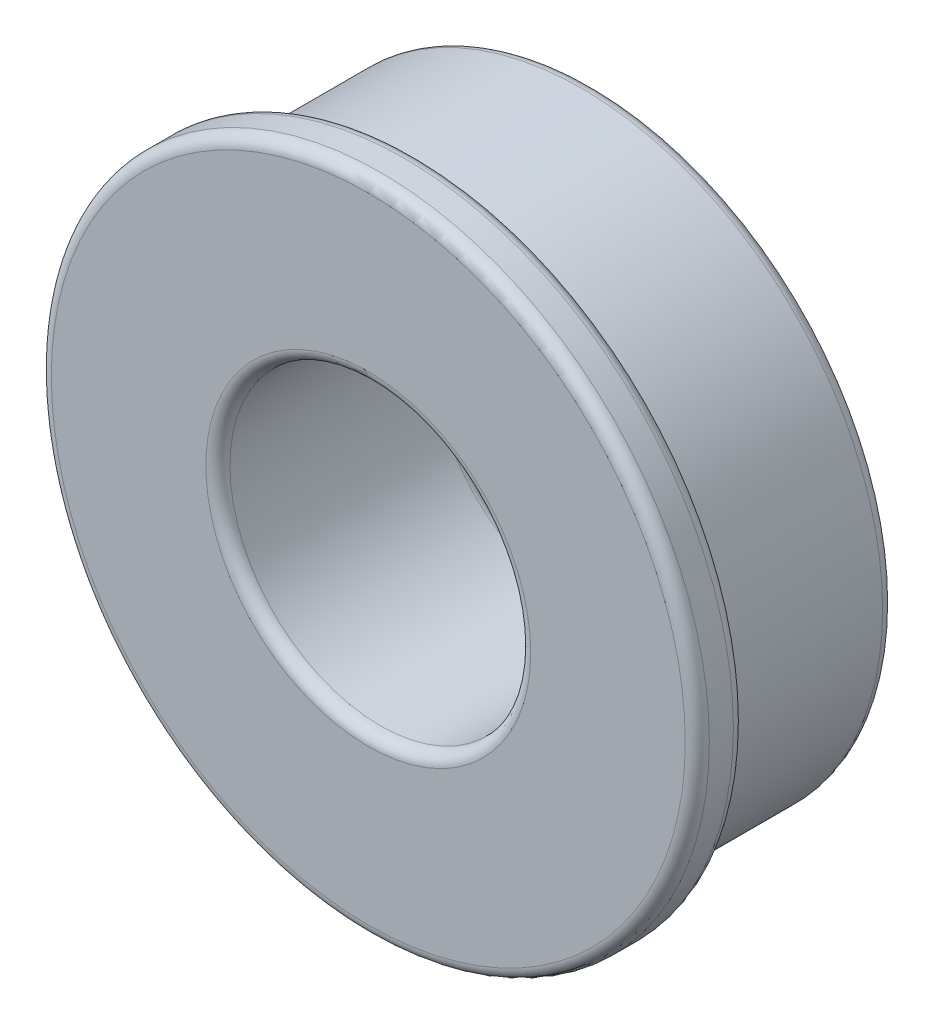
ISO-10303-21;
HEADER;
FILE_DESCRIPTION(('STEP AP214'),'2;1');
FILE_NAME('part.step','',(''),(''),'','','');
FILE_SCHEMA(('AUTOMOTIVE_DESIGN { 1 0 10303 214 1 1 1 1 }'));
ENDSEC;
DATA;
#1=APPLICATION_CONTEXT('core data for automotive mechanical design processes');
#2=APPLICATION_PROTOCOL_DEFINITION('international standard','automotive_design',2000,#1);
#3=PRODUCT_CONTEXT('',#1,'mechanical');
#4=PRODUCT('Part','Part','',(#3));
#5=PRODUCT_RELATED_PRODUCT_CATEGORY('part','',(#4));
#6=PRODUCT_DEFINITION_FORMATION('','',#4);
#7=PRODUCT_DEFINITION_CONTEXT('part definition',#1,'design');
#8=PRODUCT_DEFINITION('design','',#6,#7);
#9=PRODUCT_DEFINITION_SHAPE('','',#8);
#10=(LENGTH_UNIT() NAMED_UNIT(*) SI_UNIT(.MILLI.,.METRE.));
#11=(NAMED_UNIT(*) PLANE_ANGLE_UNIT() SI_UNIT($,.RADIAN.));
#12=(NAMED_UNIT(*) SI_UNIT($,.STERADIAN.) SOLID_ANGLE_UNIT());
#13=UNCERTAINTY_MEASURE_WITH_UNIT(LENGTH_MEASURE(1.E-05),#10,'distance_accuracy_value','');
#14=(GEOMETRIC_REPRESENTATION_CONTEXT(3) GLOBAL_UNCERTAINTY_ASSIGNED_CONTEXT((#13)) GLOBAL_UNIT_ASSIGNED_CONTEXT((#10,
#11,#12)) REPRESENTATION_CONTEXT('',''));
#15=CARTESIAN_POINT('',(0.,0.,0.));
#16=DIRECTION('',(0.,0.,1.));
#17=DIRECTION('',(1.,0.,0.));
#18=AXIS2_PLACEMENT_3D('',#15,#16,#17);
#19=CARTESIAN_POINT('',(0.,0.,4.7625));
#20=DIRECTION('',(0.,0.,-1.));
#21=DIRECTION('',(-1.,0.,0.));
#22=AXIS2_PLACEMENT_3D('',#19,#20,#21);
#23=CYLINDRICAL_SURFACE('',#22,6.35);
#24=CARTESIAN_POINT('',(0.,0.,3.4925));
#25=DIRECTION('',(0.,0.,1.));
#26=DIRECTION('',(1.,0.,0.));
#27=AXIS2_PLACEMENT_3D('',#24,#25,#26);
#28=CIRCLE('',#27,6.35);
#29=CARTESIAN_POINT('',(6.35,0.,3.4925));
#30=VERTEX_POINT('',#29);
#31=EDGE_CURVE('E61',#30,#30,#28,.F.);
#32=ORIENTED_EDGE('',*,*,#31,.T.);
#33=EDGE_LOOP('',(#32));
#34=FACE_BOUND('',#33,.T.);
#35=CARTESIAN_POINT('',(0.,0.,0.254));
#36=DIRECTION('',(0.,0.,1.));
#37=DIRECTION('',(1.,0.,0.));
#38=AXIS2_PLACEMENT_3D('',#35,#36,#37);
#39=CIRCLE('',#38,6.35);
#40=CARTESIAN_POINT('',(6.35,0.,0.254));
#41=VERTEX_POINT('',#40);
#42=EDGE_CURVE('E65',#41,#41,#39,.T.);
#43=ORIENTED_EDGE('',*,*,#42,.T.);
#44=EDGE_LOOP('',(#43));
#45=FACE_BOUND('',#44,.T.);
#46=ADVANCED_FACE('F37',(#34,#45),#23,.T.);
#47=CARTESIAN_POINT('',(0.,0.,0.));
#48=DIRECTION('',(0.,0.,1.));
#49=DIRECTION('',(1.,0.,0.));
#50=AXIS2_PLACEMENT_3D('',#47,#48,#49);
#51=PLANE('',#50);
#52=CARTESIAN_POINT('',(0.,0.,0.));
#53=DIRECTION('',(0.,0.,1.));
#54=DIRECTION('',(1.,0.,0.));
#55=AXIS2_PLACEMENT_3D('',#52,#53,#54);
#56=CIRCLE('',#55,6.096);
#57=CARTESIAN_POINT('',(6.096,0.,0.));
#58=VERTEX_POINT('',#57);
#59=EDGE_CURVE('E50',#58,#58,#56,.F.);
#60=ORIENTED_EDGE('',*,*,#59,.T.);
#61=EDGE_LOOP('',(#60));
#62=FACE_BOUND('',#61,.T.);
#63=CARTESIAN_POINT('',(0.,0.,0.));
#64=DIRECTION('',(0.,0.,1.));
#65=DIRECTION('',(1.,0.,0.));
#66=AXIS2_PLACEMENT_3D('',#63,#64,#65);
#67=CIRCLE('',#66,3.429);
#68=CARTESIAN_POINT('',(3.429,0.,0.));
#69=VERTEX_POINT('',#68);
#70=EDGE_CURVE('E55',#69,#69,#67,.T.);
#71=ORIENTED_EDGE('',*,*,#70,.T.);
#72=EDGE_LOOP('',(#71));
#73=FACE_BOUND('',#72,.T.);
#74=ADVANCED_FACE('F110',(#62,#73),#51,.F.);
#75=CARTESIAN_POINT('',(0.,0.,3.7465));
#76=DIRECTION('',(0.,0.,1.));
#77=DIRECTION('',(1.,0.,0.));
#78=AXIS2_PLACEMENT_3D('',#75,#76,#77);
#79=CYLINDRICAL_SURFACE('',#78,6.9453125);
#80=CARTESIAN_POINT('',(0.,0.,4.0005));
#81=DIRECTION('',(0.,0.,1.));
#82=DIRECTION('',(1.,0.,0.));
#83=AXIS2_PLACEMENT_3D('',#80,#81,#82);
#84=CIRCLE('',#83,6.9453125);
#85=CARTESIAN_POINT('',(6.9453125,0.,4.0005));
#86=VERTEX_POINT('',#85);
#87=EDGE_CURVE('E10',#86,#86,#84,.T.);
#88=ORIENTED_EDGE('',*,*,#87,.T.);
#89=EDGE_LOOP('',(#88));
#90=FACE_BOUND('',#89,.T.);
#91=CARTESIAN_POINT('',(0.,0.,4.5085));
#92=DIRECTION('',(0.,0.,1.));
#93=DIRECTION('',(1.,0.,0.));
#94=AXIS2_PLACEMENT_3D('',#91,#92,#93);
#95=CIRCLE('',#94,6.9453125);
#96=CARTESIAN_POINT('',(6.9453125,0.,4.5085));
#97=VERTEX_POINT('',#96);
#98=EDGE_CURVE('E45',#97,#97,#95,.F.);
#99=ORIENTED_EDGE('',*,*,#98,.T.);
#100=EDGE_LOOP('',(#99));
#101=FACE_BOUND('',#100,.T.);
#102=ADVANCED_FACE('F116',(#90,#101),#79,.T.);
#103=CARTESIAN_POINT('',(0.,0.,3.7465));
#104=DIRECTION('',(0.,0.,1.));
#105=DIRECTION('',(1.,0.,0.));
#106=AXIS2_PLACEMENT_3D('',#103,#104,#105);
#107=PLANE('',#106);
#108=CARTESIAN_POINT('',(0.,0.,3.7465));
#109=DIRECTION('',(0.,0.,1.));
#110=DIRECTION('',(1.,0.,0.));
#111=AXIS2_PLACEMENT_3D('',#108,#109,#110);
#112=CIRCLE('',#111,6.604);
#113=CARTESIAN_POINT('',(6.604,0.,3.7465));
#114=VERTEX_POINT('',#113);
#115=EDGE_CURVE('E69',#114,#114,#112,.T.);
#116=ORIENTED_EDGE('',*,*,#115,.T.);
#117=EDGE_LOOP('',(#116));
#118=FACE_BOUND('',#117,.T.);
#119=CARTESIAN_POINT('',(0.,0.,3.7465));
#120=DIRECTION('',(0.,0.,1.));
#121=DIRECTION('',(1.,0.,0.));
#122=AXIS2_PLACEMENT_3D('',#119,#120,#121);
#123=CIRCLE('',#122,6.6913125);
#124=CARTESIAN_POINT('',(6.6913125,0.,3.7465));
#125=VERTEX_POINT('',#124);
#126=EDGE_CURVE('E73',#125,#125,#123,.F.);
#127=ORIENTED_EDGE('',*,*,#126,.T.);
#128=EDGE_LOOP('',(#127));
#129=FACE_BOUND('',#128,.T.);
#130=ADVANCED_FACE('F185',(#118,#129),#107,.F.);
#131=CARTESIAN_POINT('',(0.,0.,4.7625));
#132=DIRECTION('',(0.,0.,1.));
#133=DIRECTION('',(1.,0.,0.));
#134=AXIS2_PLACEMENT_3D('',#131,#132,#133);
#135=PLANE('',#134);
#136=CARTESIAN_POINT('',(0.,0.,4.7625));
#137=DIRECTION('',(0.,0.,1.));
#138=DIRECTION('',(1.,0.,0.));
#139=AXIS2_PLACEMENT_3D('',#136,#137,#138);
#140=CIRCLE('',#139,3.429);
#141=CARTESIAN_POINT('',(3.429,0.,4.7625));
#142=VERTEX_POINT('',#141);
#143=EDGE_CURVE('E77',#142,#142,#140,.F.);
#144=ORIENTED_EDGE('',*,*,#143,.T.);
#145=EDGE_LOOP('',(#144));
#146=FACE_BOUND('',#145,.T.);
#147=CARTESIAN_POINT('',(0.,0.,4.7625));
#148=DIRECTION('',(0.,0.,1.));
#149=DIRECTION('',(1.,0.,0.));
#150=AXIS2_PLACEMENT_3D('',#147,#148,#149);
#151=CIRCLE('',#150,6.6913125);
#152=CARTESIAN_POINT('',(6.6913125,0.,4.7625));
#153=VERTEX_POINT('',#152);
#154=EDGE_CURVE('E81',#153,#153,#151,.T.);
#155=ORIENTED_EDGE('',*,*,#154,.T.);
#156=EDGE_LOOP('',(#155));
#157=FACE_BOUND('',#156,.T.);
#158=ADVANCED_FACE('F175',(#146,#157),#135,.T.);
#159=CARTESIAN_POINT('',(0.,0.,-8.98025612106915));
#160=DIRECTION('',(0.,0.,1.));
#161=DIRECTION('',(1.,0.,0.));
#162=AXIS2_PLACEMENT_3D('',#159,#160,#161);
#163=CYLINDRICAL_SURFACE('',#162,3.175);
#164=CARTESIAN_POINT('',(0.,0.,4.5085));
#165=DIRECTION('',(0.,0.,1.));
#166=DIRECTION('',(1.,0.,0.));
#167=AXIS2_PLACEMENT_3D('',#164,#165,#166);
#168=CIRCLE('',#167,3.175);
#169=CARTESIAN_POINT('',(3.175,0.,4.5085));
#170=VERTEX_POINT('',#169);
#171=EDGE_CURVE('E85',#170,#170,#168,.T.);
#172=ORIENTED_EDGE('',*,*,#171,.T.);
#173=EDGE_LOOP('',(#172));
#174=FACE_BOUND('',#173,.T.);
#175=CARTESIAN_POINT('',(0.,0.,0.254000000000001));
#176=DIRECTION('',(0.,0.,1.));
#177=DIRECTION('',(1.,0.,0.));
#178=AXIS2_PLACEMENT_3D('',#175,#176,#177);
#179=CIRCLE('',#178,3.175);
#180=CARTESIAN_POINT('',(3.175,0.,0.254000000000001));
#181=VERTEX_POINT('',#180);
#182=EDGE_CURVE('E89',#181,#181,#179,.F.);
#183=ORIENTED_EDGE('',*,*,#182,.T.);
#184=EDGE_LOOP('',(#183));
#185=FACE_BOUND('',#184,.T.);
#186=ADVANCED_FACE('F94',(#174,#185),#163,.F.);
#187=CARTESIAN_POINT('',(0.,0.,4.5085));
#188=DIRECTION('',(0.,0.,1.));
#189=DIRECTION('',(1.,0.,0.));
#190=AXIS2_PLACEMENT_3D('',#187,#188,#189);
#191=TOROIDAL_SURFACE('',#190,3.429,0.254);
#192=ORIENTED_EDGE('',*,*,#143,.F.);
#193=EDGE_LOOP('',(#192));
#194=FACE_BOUND('',#193,.T.);
#195=ORIENTED_EDGE('',*,*,#171,.F.);
#196=EDGE_LOOP('',(#195));
#197=FACE_BOUND('',#196,.T.);
#198=ADVANCED_FACE('F122',(#194,#197),#191,.T.);
#199=CARTESIAN_POINT('',(0.,0.,3.4925));
#200=DIRECTION('',(0.,0.,1.));
#201=DIRECTION('',(1.,0.,0.));
#202=AXIS2_PLACEMENT_3D('',#199,#200,#201);
#203=TOROIDAL_SURFACE('',#202,6.604,0.254);
#204=ORIENTED_EDGE('',*,*,#31,.F.);
#205=EDGE_LOOP('',(#204));
#206=FACE_BOUND('',#205,.T.);
#207=ORIENTED_EDGE('',*,*,#115,.F.);
#208=EDGE_LOOP('',(#207));
#209=FACE_BOUND('',#208,.T.);
#210=ADVANCED_FACE('F125',(#206,#209),#203,.F.);
#211=CARTESIAN_POINT('',(0.,0.,0.254));
#212=DIRECTION('',(0.,0.,1.));
#213=DIRECTION('',(1.,0.,0.));
#214=AXIS2_PLACEMENT_3D('',#211,#212,#213);
#215=TOROIDAL_SURFACE('',#214,6.096,0.254);
#216=ORIENTED_EDGE('',*,*,#59,.F.);
#217=EDGE_LOOP('',(#216));
#218=FACE_BOUND('',#217,.T.);
#219=ORIENTED_EDGE('',*,*,#42,.F.);
#220=EDGE_LOOP('',(#219));
#221=FACE_BOUND('',#220,.T.);
#222=ADVANCED_FACE('F105',(#218,#221),#215,.T.);
#223=CARTESIAN_POINT('',(0.,0.,4.0005));
#224=DIRECTION('',(0.,0.,1.));
#225=DIRECTION('',(1.,0.,0.));
#226=AXIS2_PLACEMENT_3D('',#223,#224,#225);
#227=TOROIDAL_SURFACE('',#226,6.6913125,0.254);
#228=ORIENTED_EDGE('',*,*,#126,.F.);
#229=EDGE_LOOP('',(#228));
#230=FACE_BOUND('',#229,.T.);
#231=ORIENTED_EDGE('',*,*,#87,.F.);
#232=EDGE_LOOP('',(#231));
#233=FACE_BOUND('',#232,.T.);
#234=ADVANCED_FACE('F98',(#230,#233),#227,.T.);
#235=CARTESIAN_POINT('',(0.,0.,0.254000000000001));
#236=DIRECTION('',(0.,0.,1.));
#237=DIRECTION('',(1.,0.,0.));
#238=AXIS2_PLACEMENT_3D('',#235,#236,#237);
#239=TOROIDAL_SURFACE('',#238,3.429,0.254);
#240=ORIENTED_EDGE('',*,*,#70,.F.);
#241=EDGE_LOOP('',(#240));
#242=FACE_BOUND('',#241,.T.);
#243=ORIENTED_EDGE('',*,*,#182,.F.);
#244=EDGE_LOOP('',(#243));
#245=FACE_BOUND('',#244,.T.);
#246=ADVANCED_FACE('F96',(#242,#245),#239,.T.);
#247=CARTESIAN_POINT('',(0.,0.,4.5085));
#248=DIRECTION('',(0.,0.,1.));
#249=DIRECTION('',(1.,0.,0.));
#250=AXIS2_PLACEMENT_3D('',#247,#248,#249);
#251=TOROIDAL_SURFACE('',#250,6.6913125,0.254);
#252=ORIENTED_EDGE('',*,*,#98,.F.);
#253=EDGE_LOOP('',(#252));
#254=FACE_BOUND('',#253,.T.);
#255=ORIENTED_EDGE('',*,*,#154,.F.);
#256=EDGE_LOOP('',(#255));
#257=FACE_BOUND('',#256,.T.);
#258=ADVANCED_FACE('F39',(#254,#257),#251,.T.);
#259=CLOSED_SHELL('',(#46,#74,#102,#130,#158,#186,#198,#210,#222,#234,#246,#258));
#260=MANIFOLD_SOLID_BREP('B2',#259);
#261=ADVANCED_BREP_SHAPE_REPRESENTATION('',(#18,#260),#14);
#262=SHAPE_DEFINITION_REPRESENTATION(#9,#261);
ENDSEC;
END-ISO-10303-21;
